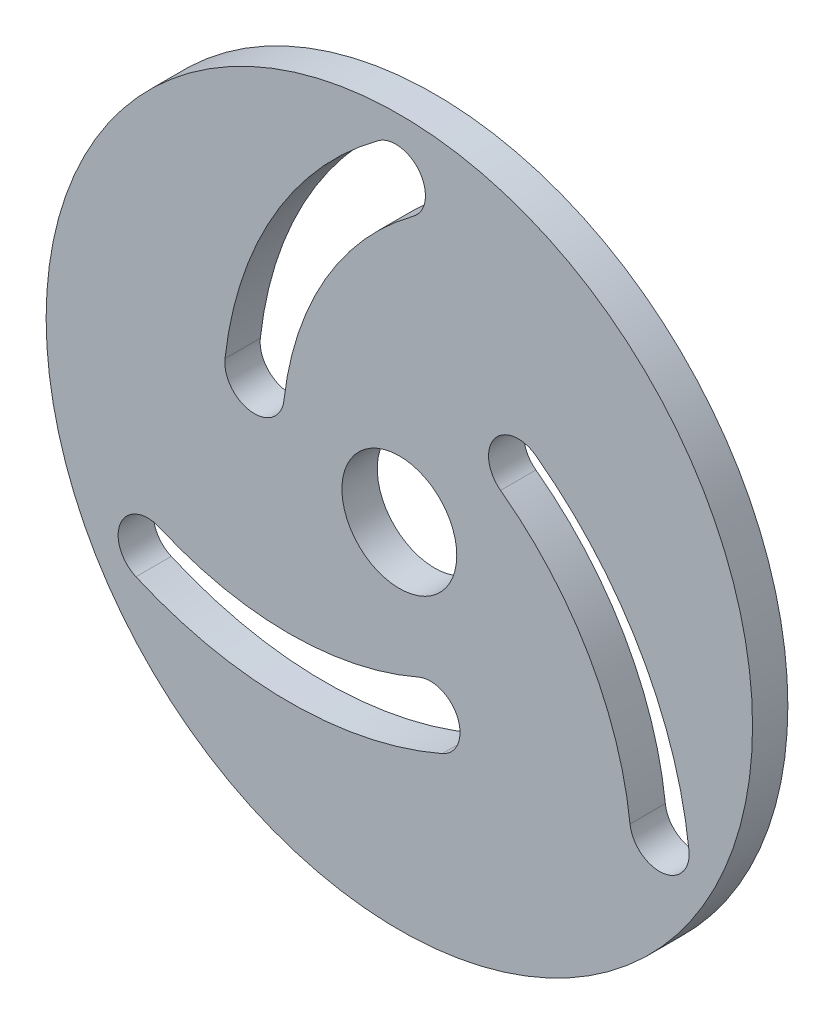
ISO-10303-21;
HEADER;
FILE_DESCRIPTION(('STEP AP214'),'2;1');
FILE_NAME('part.step','',(''),(''),'','','');
FILE_SCHEMA(('AUTOMOTIVE_DESIGN { 1 0 10303 214 1 1 1 1 }'));
ENDSEC;
DATA;
#1=APPLICATION_CONTEXT('core data for automotive mechanical design processes');
#2=APPLICATION_PROTOCOL_DEFINITION('international standard','automotive_design',2000,#1);
#3=PRODUCT_CONTEXT('',#1,'mechanical');
#4=PRODUCT('Part','Part','',(#3));
#5=PRODUCT_RELATED_PRODUCT_CATEGORY('part','',(#4));
#6=PRODUCT_DEFINITION_FORMATION('','',#4);
#7=PRODUCT_DEFINITION_CONTEXT('part definition',#1,'design');
#8=PRODUCT_DEFINITION('design','',#6,#7);
#9=PRODUCT_DEFINITION_SHAPE('','',#8);
#10=(LENGTH_UNIT() NAMED_UNIT(*) SI_UNIT(.MILLI.,.METRE.));
#11=(NAMED_UNIT(*) PLANE_ANGLE_UNIT() SI_UNIT($,.RADIAN.));
#12=(NAMED_UNIT(*) SI_UNIT($,.STERADIAN.) SOLID_ANGLE_UNIT());
#13=UNCERTAINTY_MEASURE_WITH_UNIT(LENGTH_MEASURE(1.E-05),#10,'distance_accuracy_value','');
#14=(GEOMETRIC_REPRESENTATION_CONTEXT(3) GLOBAL_UNCERTAINTY_ASSIGNED_CONTEXT((#13)) GLOBAL_UNIT_ASSIGNED_CONTEXT((#10,
#11,#12)) REPRESENTATION_CONTEXT('',''));
#15=CARTESIAN_POINT('',(0.,0.,0.));
#16=DIRECTION('',(0.,0.,1.));
#17=DIRECTION('',(1.,0.,0.));
#18=AXIS2_PLACEMENT_3D('',#15,#16,#17);
#19=CARTESIAN_POINT('',(-31.8476380113562,10.1977129006949,2.5));
#20=DIRECTION('',(0.,0.,-1.));
#21=DIRECTION('',(-1.,0.,0.));
#22=AXIS2_PLACEMENT_3D('',#19,#20,#21);
#23=CYLINDRICAL_SURFACE('',#22,2.1);
#24=CARTESIAN_POINT('',(-31.8476380113562,10.1977129006949,0.));
#25=DIRECTION('',(0.,0.,1.));
#26=DIRECTION('',(1.,0.,0.));
#27=AXIS2_PLACEMENT_3D('',#24,#25,#26);
#28=CIRCLE('',#27,2.1);
#29=CARTESIAN_POINT('',(-33.9344613373269,10.4325924574567,0.));
#30=VERTEX_POINT('',#29);
#31=CARTESIAN_POINT('',(-29.7608146853855,9.9628333439331,0.));
#32=VERTEX_POINT('',#31);
#33=EDGE_CURVE('E186',#30,#32,#28,.T.);
#34=ORIENTED_EDGE('',*,*,#33,.F.);
#35=DIRECTION('',(0.,0.,-1.));
#36=VECTOR('',#35,1.);
#37=CARTESIAN_POINT('',(-33.9344613373269,10.4325924574567,2.5));
#38=LINE('',#37,#36);
#39=CARTESIAN_POINT('',(-33.9344613373269,10.4325924574567,2.5));
#40=VERTEX_POINT('',#39);
#41=EDGE_CURVE('E11',#40,#30,#38,.T.);
#42=ORIENTED_EDGE('',*,*,#41,.F.);
#43=CARTESIAN_POINT('',(-31.8476380113562,10.1977129006949,2.5));
#44=DIRECTION('',(0.,0.,1.));
#45=DIRECTION('',(1.,0.,0.));
#46=AXIS2_PLACEMENT_3D('',#43,#44,#45);
#47=CIRCLE('',#46,2.1);
#48=CARTESIAN_POINT('',(-29.7608146853855,9.9628333439331,2.5));
#49=VERTEX_POINT('',#48);
#50=EDGE_CURVE('E148',#40,#49,#47,.T.);
#51=ORIENTED_EDGE('',*,*,#50,.T.);
#52=DIRECTION('',(0.,0.,-1.));
#53=VECTOR('',#52,1.);
#54=CARTESIAN_POINT('',(-29.7608146853855,9.9628333439331,2.5));
#55=LINE('',#54,#53);
#56=EDGE_CURVE('E100',#49,#32,#55,.T.);
#57=ORIENTED_EDGE('',*,*,#56,.T.);
#58=EDGE_LOOP('',(#34,#42,#51,#57));
#59=FACE_BOUND('',#58,.T.);
#60=ADVANCED_FACE('F35',(#59),#23,.F.);
#61=CARTESIAN_POINT('',(-7.00450317837179,7.40152770114974,2.5));
#62=DIRECTION('',(0.,0.,-1.));
#63=DIRECTION('',(-1.,0.,0.));
#64=AXIS2_PLACEMENT_3D('',#61,#62,#63);
#65=CYLINDRICAL_SURFACE('',#64,27.1);
#66=CARTESIAN_POINT('',(-7.00450317837179,7.40152770114974,0.));
#67=DIRECTION('',(0.,0.,1.));
#68=DIRECTION('',(1.,0.,0.));
#69=AXIS2_PLACEMENT_3D('',#66,#67,#68);
#70=CIRCLE('',#69,27.1);
#71=CARTESIAN_POINT('',(-23.094461337327,29.2080232115033,0.));
#72=VERTEX_POINT('',#71);
#73=EDGE_CURVE('E139',#72,#30,#70,.T.);
#74=ORIENTED_EDGE('',*,*,#73,.F.);
#75=DIRECTION('',(0.,0.,-1.));
#76=VECTOR('',#75,1.);
#77=CARTESIAN_POINT('',(-23.094461337327,29.2080232115033,2.5));
#78=LINE('',#77,#76);
#79=CARTESIAN_POINT('',(-23.094461337327,29.2080232115033,2.5));
#80=VERTEX_POINT('',#79);
#81=EDGE_CURVE('E45',#80,#72,#78,.T.);
#82=ORIENTED_EDGE('',*,*,#81,.F.);
#83=CARTESIAN_POINT('',(-7.00450317837179,7.40152770114974,2.5));
#84=DIRECTION('',(0.,0.,1.));
#85=DIRECTION('',(1.,0.,0.));
#86=AXIS2_PLACEMENT_3D('',#83,#84,#85);
#87=CIRCLE('',#86,27.1);
#88=EDGE_CURVE('E137',#80,#40,#87,.T.);
#89=ORIENTED_EDGE('',*,*,#88,.T.);
#90=ORIENTED_EDGE('',*,*,#41,.T.);
#91=EDGE_LOOP('',(#74,#82,#89,#90));
#92=FACE_BOUND('',#91,.T.);
#93=ADVANCED_FACE('F136',(#92),#65,.F.);
#94=CARTESIAN_POINT('',(-21.8476380113563,27.5182209763837,2.5));
#95=DIRECTION('',(0.,0.,-1.));
#96=DIRECTION('',(-1.,0.,0.));
#97=AXIS2_PLACEMENT_3D('',#94,#95,#96);
#98=CYLINDRICAL_SURFACE('',#97,2.1);
#99=CARTESIAN_POINT('',(-21.8476380113563,27.5182209763837,0.));
#100=DIRECTION('',(0.,0.,1.));
#101=DIRECTION('',(1.,0.,0.));
#102=AXIS2_PLACEMENT_3D('',#99,#100,#101);
#103=CIRCLE('',#102,2.1);
#104=CARTESIAN_POINT('',(-20.6008146853856,25.828418741264,0.));
#105=VERTEX_POINT('',#104);
#106=EDGE_CURVE('E190',#105,#72,#103,.T.);
#107=ORIENTED_EDGE('',*,*,#106,.F.);
#108=DIRECTION('',(0.,0.,-1.));
#109=VECTOR('',#108,1.);
#110=CARTESIAN_POINT('',(-20.6008146853856,25.828418741264,2.5));
#111=LINE('',#110,#109);
#112=CARTESIAN_POINT('',(-20.6008146853856,25.828418741264,2.5));
#113=VERTEX_POINT('',#112);
#114=EDGE_CURVE('E93',#113,#105,#111,.T.);
#115=ORIENTED_EDGE('',*,*,#114,.F.);
#116=CARTESIAN_POINT('',(-21.8476380113563,27.5182209763837,2.5));
#117=DIRECTION('',(0.,0.,1.));
#118=DIRECTION('',(1.,0.,0.));
#119=AXIS2_PLACEMENT_3D('',#116,#117,#118);
#120=CIRCLE('',#119,2.1);
#121=EDGE_CURVE('E147',#113,#80,#120,.T.);
#122=ORIENTED_EDGE('',*,*,#121,.T.);
#123=ORIENTED_EDGE('',*,*,#81,.T.);
#124=EDGE_LOOP('',(#107,#115,#122,#123));
#125=FACE_BOUND('',#124,.T.);
#126=ADVANCED_FACE('F150',(#125),#98,.F.);
#127=CARTESIAN_POINT('',(-28.0242802410875,-6.32008961851441,2.5));
#128=DIRECTION('',(0.,0.,-1.));
#129=DIRECTION('',(-1.,0.,0.));
#130=AXIS2_PLACEMENT_3D('',#127,#128,#129);
#131=CYLINDRICAL_SURFACE('',#130,27.1);
#132=CARTESIAN_POINT('',(-28.0242802410875,-6.32008961851441,0.));
#133=DIRECTION('',(0.,0.,1.));
#134=DIRECTION('',(1.,0.,0.));
#135=AXIS2_PLACEMENT_3D('',#132,#133,#134);
#136=CIRCLE('',#135,27.1);
#137=CARTESIAN_POINT('',(-1.09432208213236,-3.28902486220731,0.));
#138=VERTEX_POINT('',#137);
#139=CARTESIAN_POINT('',(-11.9343220821324,15.4864058918393,0.));
#140=VERTEX_POINT('',#139);
#141=EDGE_CURVE('E174',#138,#140,#136,.T.);
#142=ORIENTED_EDGE('',*,*,#141,.F.);
#143=DIRECTION('',(0.,0.,-1.));
#144=VECTOR('',#143,1.);
#145=CARTESIAN_POINT('',(-1.09432208213236,-3.28902486220731,2.5));
#146=LINE('',#145,#144);
#147=CARTESIAN_POINT('',(-1.09432208213236,-3.28902486220731,2.5));
#148=VERTEX_POINT('',#147);
#149=EDGE_CURVE('E202',#148,#138,#146,.T.);
#150=ORIENTED_EDGE('',*,*,#149,.F.);
#151=CARTESIAN_POINT('',(-28.0242802410875,-6.32008961851441,2.5));
#152=DIRECTION('',(0.,0.,1.));
#153=DIRECTION('',(1.,0.,0.));
#154=AXIS2_PLACEMENT_3D('',#151,#152,#153);
#155=CIRCLE('',#154,27.1);
#156=CARTESIAN_POINT('',(-11.9343220821324,15.4864058918393,2.5));
#157=VERTEX_POINT('',#156);
#158=EDGE_CURVE('E236',#148,#157,#155,.T.);
#159=ORIENTED_EDGE('',*,*,#158,.T.);
#160=DIRECTION('',(0.,0.,-1.));
#161=VECTOR('',#160,1.);
#162=CARTESIAN_POINT('',(-11.9343220821324,15.4864058918393,2.5));
#163=LINE('',#162,#161);
#164=EDGE_CURVE('E204',#157,#140,#163,.T.);
#165=ORIENTED_EDGE('',*,*,#164,.T.);
#166=EDGE_LOOP('',(#142,#150,#159,#165));
#167=FACE_BOUND('',#166,.T.);
#168=ADVANCED_FACE('F280',(#167),#131,.F.);
#169=CARTESIAN_POINT('',(-3.18114540810305,-3.5239044189691,2.5));
#170=DIRECTION('',(0.,0.,-1.));
#171=DIRECTION('',(-1.,0.,0.));
#172=AXIS2_PLACEMENT_3D('',#169,#170,#171);
#173=CYLINDRICAL_SURFACE('',#172,2.1);
#174=CARTESIAN_POINT('',(-3.18114540810305,-3.5239044189691,0.));
#175=DIRECTION('',(0.,0.,1.));
#176=DIRECTION('',(1.,0.,0.));
#177=AXIS2_PLACEMENT_3D('',#174,#175,#176);
#178=CIRCLE('',#177,2.1);
#179=CARTESIAN_POINT('',(-5.26796873407375,-3.75878397573092,0.));
#180=VERTEX_POINT('',#179);
#181=EDGE_CURVE('E177',#180,#138,#178,.T.);
#182=ORIENTED_EDGE('',*,*,#181,.F.);
#183=DIRECTION('',(0.,0.,-1.));
#184=VECTOR('',#183,1.);
#185=CARTESIAN_POINT('',(-5.26796873407375,-3.75878397573092,2.5));
#186=LINE('',#185,#184);
#187=CARTESIAN_POINT('',(-5.26796873407375,-3.75878397573092,2.5));
#188=VERTEX_POINT('',#187);
#189=EDGE_CURVE('E208',#188,#180,#186,.T.);
#190=ORIENTED_EDGE('',*,*,#189,.F.);
#191=CARTESIAN_POINT('',(-3.18114540810305,-3.5239044189691,2.5));
#192=DIRECTION('',(0.,0.,1.));
#193=DIRECTION('',(1.,0.,0.));
#194=AXIS2_PLACEMENT_3D('',#191,#192,#193);
#195=CIRCLE('',#194,2.1);
#196=EDGE_CURVE('E239',#188,#148,#195,.T.);
#197=ORIENTED_EDGE('',*,*,#196,.T.);
#198=ORIENTED_EDGE('',*,*,#149,.T.);
#199=EDGE_LOOP('',(#182,#190,#197,#198));
#200=FACE_BOUND('',#199,.T.);
#201=ADVANCED_FACE('F276',(#200),#173,.F.);
#202=CARTESIAN_POINT('',(-28.0242802410875,-6.32008961851441,2.5));
#203=DIRECTION('',(0.,0.,-1.));
#204=DIRECTION('',(-1.,0.,0.));
#205=AXIS2_PLACEMENT_3D('',#202,#203,#204);
#206=CYLINDRICAL_SURFACE('',#205,22.9);
#207=CARTESIAN_POINT('',(-28.0242802410875,-6.32008961851441,0.));
#208=DIRECTION('',(0.,0.,1.));
#209=DIRECTION('',(1.,0.,0.));
#210=AXIS2_PLACEMENT_3D('',#207,#208,#209);
#211=CIRCLE('',#210,22.9);
#212=CARTESIAN_POINT('',(-14.4279687340738,12.1068014216,0.));
#213=VERTEX_POINT('',#212);
#214=EDGE_CURVE('E180',#180,#213,#211,.T.);
#215=ORIENTED_EDGE('',*,*,#214,.T.);
#216=DIRECTION('',(0.,0.,-1.));
#217=VECTOR('',#216,1.);
#218=CARTESIAN_POINT('',(-14.4279687340738,12.1068014216,2.5));
#219=LINE('',#218,#217);
#220=CARTESIAN_POINT('',(-14.4279687340738,12.1068014216,2.5));
#221=VERTEX_POINT('',#220);
#222=EDGE_CURVE('E206',#221,#213,#219,.T.);
#223=ORIENTED_EDGE('',*,*,#222,.F.);
#224=CARTESIAN_POINT('',(-28.0242802410875,-6.32008961851441,2.5));
#225=DIRECTION('',(0.,0.,1.));
#226=DIRECTION('',(1.,0.,0.));
#227=AXIS2_PLACEMENT_3D('',#224,#225,#226);
#228=CIRCLE('',#227,22.9);
#229=EDGE_CURVE('E246',#188,#221,#228,.T.);
#230=ORIENTED_EDGE('',*,*,#229,.F.);
#231=ORIENTED_EDGE('',*,*,#189,.T.);
#232=EDGE_LOOP('',(#215,#223,#230,#231));
#233=FACE_BOUND('',#232,.T.);
#234=ADVANCED_FACE('F273',(#233),#206,.T.);
#235=CARTESIAN_POINT('',(-29.3976608895673,18.7443799595149,2.5));
#236=DIRECTION('',(0.,0.,-1.));
#237=DIRECTION('',(-1.,0.,0.));
#238=AXIS2_PLACEMENT_3D('',#235,#236,#237);
#239=CYLINDRICAL_SURFACE('',#238,27.1);
#240=CARTESIAN_POINT('',(-29.3976608895673,18.7443799595149,0.));
#241=DIRECTION('',(0.,0.,1.));
#242=DIRECTION('',(1.,0.,0.));
#243=AXIS2_PLACEMENT_3D('',#240,#241,#242);
#244=CIRCLE('',#243,27.1);
#245=CARTESIAN_POINT('',(-40.2376608895673,-6.09318030714579,0.));
#246=VERTEX_POINT('',#245);
#247=CARTESIAN_POINT('',(-18.5576608895672,-6.09318030714571,0.));
#248=VERTEX_POINT('',#247);
#249=EDGE_CURVE('E162',#246,#248,#244,.T.);
#250=ORIENTED_EDGE('',*,*,#249,.F.);
#251=DIRECTION('',(0.,0.,-1.));
#252=VECTOR('',#251,1.);
#253=CARTESIAN_POINT('',(-40.2376608895673,-6.09318030714579,2.5));
#254=LINE('',#253,#252);
#255=CARTESIAN_POINT('',(-40.2376608895673,-6.09318030714579,2.5));
#256=VERTEX_POINT('',#255);
#257=EDGE_CURVE('E39',#256,#246,#254,.T.);
#258=ORIENTED_EDGE('',*,*,#257,.F.);
#259=CARTESIAN_POINT('',(-29.3976608895673,18.7443799595149,2.5));
#260=DIRECTION('',(0.,0.,1.));
#261=DIRECTION('',(1.,0.,0.));
#262=AXIS2_PLACEMENT_3D('',#259,#260,#261);
#263=CIRCLE('',#262,27.1);
#264=CARTESIAN_POINT('',(-18.5576608895672,-6.09318030714571,2.5));
#265=VERTEX_POINT('',#264);
#266=EDGE_CURVE('E200',#256,#265,#263,.T.);
#267=ORIENTED_EDGE('',*,*,#266,.T.);
#268=DIRECTION('',(0.,0.,-1.));
#269=VECTOR('',#268,1.);
#270=CARTESIAN_POINT('',(-18.5576608895672,-6.09318030714571,2.5));
#271=LINE('',#270,#269);
#272=EDGE_CURVE('E161',#265,#248,#271,.T.);
#273=ORIENTED_EDGE('',*,*,#272,.T.);
#274=EDGE_LOOP('',(#250,#258,#267,#273));
#275=FACE_BOUND('',#274,.T.);
#276=ADVANCED_FACE('F37',(#275),#239,.F.);
#277=CARTESIAN_POINT('',(-39.3976608895673,-4.16849851526433,2.5));
#278=DIRECTION('',(0.,0.,-1.));
#279=DIRECTION('',(-1.,0.,0.));
#280=AXIS2_PLACEMENT_3D('',#277,#278,#279);
#281=CYLINDRICAL_SURFACE('',#280,2.1);
#282=CARTESIAN_POINT('',(-39.3976608895673,-4.16849851526433,0.));
#283=DIRECTION('',(0.,0.,1.));
#284=DIRECTION('',(1.,0.,0.));
#285=AXIS2_PLACEMENT_3D('',#282,#283,#284);
#286=CIRCLE('',#285,2.1);
#287=CARTESIAN_POINT('',(-38.5576608895673,-2.24381672338287,0.));
#288=VERTEX_POINT('',#287);
#289=EDGE_CURVE('E165',#288,#246,#286,.T.);
#290=ORIENTED_EDGE('',*,*,#289,.F.);
#291=DIRECTION('',(0.,0.,-1.));
#292=VECTOR('',#291,1.);
#293=CARTESIAN_POINT('',(-38.5576608895673,-2.24381672338287,2.5));
#294=LINE('',#293,#292);
#295=CARTESIAN_POINT('',(-38.5576608895673,-2.24381672338287,2.5));
#296=VERTEX_POINT('',#295);
#297=EDGE_CURVE('E213',#296,#288,#294,.T.);
#298=ORIENTED_EDGE('',*,*,#297,.F.);
#299=CARTESIAN_POINT('',(-39.3976608895673,-4.16849851526433,2.5));
#300=DIRECTION('',(0.,0.,1.));
#301=DIRECTION('',(1.,0.,0.));
#302=AXIS2_PLACEMENT_3D('',#299,#300,#301);
#303=CIRCLE('',#302,2.1);
#304=EDGE_CURVE('E222',#296,#256,#303,.T.);
#305=ORIENTED_EDGE('',*,*,#304,.T.);
#306=ORIENTED_EDGE('',*,*,#257,.T.);
#307=EDGE_LOOP('',(#290,#298,#305,#306));
#308=FACE_BOUND('',#307,.T.);
#309=ADVANCED_FACE('F220',(#308),#281,.F.);
#310=CARTESIAN_POINT('',(-29.3976608895673,18.7443799595149,2.5));
#311=DIRECTION('',(0.,0.,-1.));
#312=DIRECTION('',(-1.,0.,0.));
#313=AXIS2_PLACEMENT_3D('',#310,#311,#312);
#314=CYLINDRICAL_SURFACE('',#313,22.9);
#315=CARTESIAN_POINT('',(-29.3976608895673,18.7443799595149,0.));
#316=DIRECTION('',(0.,0.,1.));
#317=DIRECTION('',(1.,0.,0.));
#318=AXIS2_PLACEMENT_3D('',#315,#316,#317);
#319=CIRCLE('',#318,22.9);
#320=CARTESIAN_POINT('',(-20.2376608895673,-2.24381672338281,0.));
#321=VERTEX_POINT('',#320);
#322=EDGE_CURVE('E168',#288,#321,#319,.T.);
#323=ORIENTED_EDGE('',*,*,#322,.T.);
#324=DIRECTION('',(0.,0.,-1.));
#325=VECTOR('',#324,1.);
#326=CARTESIAN_POINT('',(-20.2376608895673,-2.24381672338281,2.5));
#327=LINE('',#326,#325);
#328=CARTESIAN_POINT('',(-20.2376608895673,-2.24381672338281,2.5));
#329=VERTEX_POINT('',#328);
#330=EDGE_CURVE('E212',#329,#321,#327,.T.);
#331=ORIENTED_EDGE('',*,*,#330,.F.);
#332=CARTESIAN_POINT('',(-29.3976608895673,18.7443799595149,2.5));
#333=DIRECTION('',(0.,0.,1.));
#334=DIRECTION('',(1.,0.,0.));
#335=AXIS2_PLACEMENT_3D('',#332,#333,#334);
#336=CIRCLE('',#335,22.9);
#337=EDGE_CURVE('E230',#296,#329,#336,.T.);
#338=ORIENTED_EDGE('',*,*,#337,.F.);
#339=ORIENTED_EDGE('',*,*,#297,.T.);
#340=EDGE_LOOP('',(#323,#331,#338,#339));
#341=FACE_BOUND('',#340,.T.);
#342=ADVANCED_FACE('F228',(#341),#314,.T.);
#343=CARTESIAN_POINT('',(-21.5945908318808,6.57444440269253,2.5));
#344=DIRECTION('',(0.,0.,-1.));
#345=DIRECTION('',(-1.,0.,0.));
#346=AXIS2_PLACEMENT_3D('',#343,#344,#345);
#347=CYLINDRICAL_SURFACE('',#346,4.064);
#348=CARTESIAN_POINT('',(-21.5945908318808,6.57444440269253,2.5));
#349=DIRECTION('',(0.,0.,1.));
#350=DIRECTION('',(1.,0.,0.));
#351=AXIS2_PLACEMENT_3D('',#348,#349,#350);
#352=CIRCLE('',#351,4.064);
#353=CARTESIAN_POINT('',(-17.5305908318808,6.57444440269253,2.5));
#354=VERTEX_POINT('',#353);
#355=EDGE_CURVE('E152',#354,#354,#352,.T.);
#356=ORIENTED_EDGE('',*,*,#355,.T.);
#357=EDGE_LOOP('',(#356));
#358=FACE_BOUND('',#357,.T.);
#359=CARTESIAN_POINT('',(-21.5945908318808,6.57444440269253,0.));
#360=DIRECTION('',(0.,0.,1.));
#361=DIRECTION('',(1.,0.,0.));
#362=AXIS2_PLACEMENT_3D('',#359,#360,#361);
#363=CIRCLE('',#362,4.064);
#364=CARTESIAN_POINT('',(-17.5305908318808,6.57444440269253,0.));
#365=VERTEX_POINT('',#364);
#366=EDGE_CURVE('E194',#365,#365,#363,.T.);
#367=ORIENTED_EDGE('',*,*,#366,.F.);
#368=EDGE_LOOP('',(#367));
#369=FACE_BOUND('',#368,.T.);
#370=ADVANCED_FACE('F255',(#358,#369),#347,.F.);
#371=CARTESIAN_POINT('',(-7.00450317837179,7.40152770114974,2.5));
#372=DIRECTION('',(0.,0.,-1.));
#373=DIRECTION('',(-1.,0.,0.));
#374=AXIS2_PLACEMENT_3D('',#371,#372,#373);
#375=CYLINDRICAL_SURFACE('',#374,22.9);
#376=CARTESIAN_POINT('',(-7.00450317837179,7.40152770114974,0.));
#377=DIRECTION('',(0.,0.,1.));
#378=DIRECTION('',(1.,0.,0.));
#379=AXIS2_PLACEMENT_3D('',#376,#377,#378);
#380=CIRCLE('',#379,22.9);
#381=EDGE_CURVE('E192',#105,#32,#380,.T.);
#382=ORIENTED_EDGE('',*,*,#381,.T.);
#383=ORIENTED_EDGE('',*,*,#56,.F.);
#384=CARTESIAN_POINT('',(-7.00450317837179,7.40152770114974,2.5));
#385=DIRECTION('',(0.,0.,1.));
#386=DIRECTION('',(1.,0.,0.));
#387=AXIS2_PLACEMENT_3D('',#384,#385,#386);
#388=CIRCLE('',#387,22.9);
#389=EDGE_CURVE('E54',#113,#49,#388,.T.);
#390=ORIENTED_EDGE('',*,*,#389,.F.);
#391=ORIENTED_EDGE('',*,*,#114,.T.);
#392=EDGE_LOOP('',(#382,#383,#390,#391));
#393=FACE_BOUND('',#392,.T.);
#394=ADVANCED_FACE('F252',(#393),#375,.T.);
#395=CARTESIAN_POINT('',(-13.1811454081031,13.7966036567196,2.5));
#396=DIRECTION('',(0.,0.,-1.));
#397=DIRECTION('',(-1.,0.,0.));
#398=AXIS2_PLACEMENT_3D('',#395,#396,#397);
#399=CYLINDRICAL_SURFACE('',#398,2.1);
#400=CARTESIAN_POINT('',(-13.1811454081031,13.7966036567196,0.));
#401=DIRECTION('',(0.,0.,1.));
#402=DIRECTION('',(1.,0.,0.));
#403=AXIS2_PLACEMENT_3D('',#400,#401,#402);
#404=CIRCLE('',#403,2.1);
#405=EDGE_CURVE('E183',#140,#213,#404,.T.);
#406=ORIENTED_EDGE('',*,*,#405,.F.);
#407=ORIENTED_EDGE('',*,*,#164,.F.);
#408=CARTESIAN_POINT('',(-13.1811454081031,13.7966036567196,2.5));
#409=DIRECTION('',(0.,0.,1.));
#410=DIRECTION('',(1.,0.,0.));
#411=AXIS2_PLACEMENT_3D('',#408,#409,#410);
#412=CIRCLE('',#411,2.1);
#413=EDGE_CURVE('E248',#157,#221,#412,.T.);
#414=ORIENTED_EDGE('',*,*,#413,.T.);
#415=ORIENTED_EDGE('',*,*,#222,.T.);
#416=EDGE_LOOP('',(#406,#407,#414,#415));
#417=FACE_BOUND('',#416,.T.);
#418=ADVANCED_FACE('F254',(#417),#399,.F.);
#419=CARTESIAN_POINT('',(-19.3976608895673,-4.16849851526426,2.5));
#420=DIRECTION('',(0.,0.,-1.));
#421=DIRECTION('',(-1.,0.,0.));
#422=AXIS2_PLACEMENT_3D('',#419,#420,#421);
#423=CYLINDRICAL_SURFACE('',#422,2.1);
#424=CARTESIAN_POINT('',(-19.3976608895673,-4.16849851526426,0.));
#425=DIRECTION('',(0.,0.,1.));
#426=DIRECTION('',(1.,0.,0.));
#427=AXIS2_PLACEMENT_3D('',#424,#425,#426);
#428=CIRCLE('',#427,2.1);
#429=EDGE_CURVE('E171',#248,#321,#428,.T.);
#430=ORIENTED_EDGE('',*,*,#429,.F.);
#431=ORIENTED_EDGE('',*,*,#272,.F.);
#432=CARTESIAN_POINT('',(-19.3976608895673,-4.16849851526426,2.5));
#433=DIRECTION('',(0.,0.,1.));
#434=DIRECTION('',(1.,0.,0.));
#435=AXIS2_PLACEMENT_3D('',#432,#433,#434);
#436=CIRCLE('',#435,2.1);
#437=EDGE_CURVE('E233',#265,#329,#436,.T.);
#438=ORIENTED_EDGE('',*,*,#437,.T.);
#439=ORIENTED_EDGE('',*,*,#330,.T.);
#440=EDGE_LOOP('',(#430,#431,#438,#439));
#441=FACE_BOUND('',#440,.T.);
#442=ADVANCED_FACE('F234',(#441),#423,.F.);
#443=CARTESIAN_POINT('',(-21.5945908318808,6.57444440269253,2.5));
#444=DIRECTION('',(0.,0.,-1.));
#445=DIRECTION('',(-1.,0.,0.));
#446=AXIS2_PLACEMENT_3D('',#443,#444,#445);
#447=CYLINDRICAL_SURFACE('',#446,25.);
#448=CARTESIAN_POINT('',(-21.5945908318808,6.57444440269253,2.5));
#449=DIRECTION('',(0.,0.,1.));
#450=DIRECTION('',(1.,0.,0.));
#451=AXIS2_PLACEMENT_3D('',#448,#449,#450);
#452=CIRCLE('',#451,25.);
#453=CARTESIAN_POINT('',(3.40540916811924,6.57444440269253,2.5));
#454=VERTEX_POINT('',#453);
#455=EDGE_CURVE('E158',#454,#454,#452,.T.);
#456=ORIENTED_EDGE('',*,*,#455,.F.);
#457=EDGE_LOOP('',(#456));
#458=FACE_BOUND('',#457,.T.);
#459=CARTESIAN_POINT('',(-21.5945908318808,6.57444440269253,0.));
#460=DIRECTION('',(0.,0.,1.));
#461=DIRECTION('',(1.,0.,0.));
#462=AXIS2_PLACEMENT_3D('',#459,#460,#461);
#463=CIRCLE('',#462,25.);
#464=CARTESIAN_POINT('',(3.40540916811924,6.57444440269253,0.));
#465=VERTEX_POINT('',#464);
#466=EDGE_CURVE('E197',#465,#465,#463,.T.);
#467=ORIENTED_EDGE('',*,*,#466,.T.);
#468=EDGE_LOOP('',(#467));
#469=FACE_BOUND('',#468,.T.);
#470=ADVANCED_FACE('F287',(#458,#469),#447,.T.);
#471=CARTESIAN_POINT('',(0.,0.,2.5));
#472=DIRECTION('',(0.,0.,1.));
#473=DIRECTION('',(1.,0.,0.));
#474=AXIS2_PLACEMENT_3D('',#471,#472,#473);
#475=PLANE('',#474);
#476=ORIENTED_EDGE('',*,*,#266,.F.);
#477=ORIENTED_EDGE('',*,*,#304,.F.);
#478=ORIENTED_EDGE('',*,*,#337,.T.);
#479=ORIENTED_EDGE('',*,*,#437,.F.);
#480=EDGE_LOOP('',(#476,#477,#478,#479));
#481=FACE_BOUND('',#480,.T.);
#482=ORIENTED_EDGE('',*,*,#158,.F.);
#483=ORIENTED_EDGE('',*,*,#196,.F.);
#484=ORIENTED_EDGE('',*,*,#229,.T.);
#485=ORIENTED_EDGE('',*,*,#413,.F.);
#486=EDGE_LOOP('',(#482,#483,#484,#485));
#487=FACE_BOUND('',#486,.T.);
#488=ORIENTED_EDGE('',*,*,#50,.F.);
#489=ORIENTED_EDGE('',*,*,#88,.F.);
#490=ORIENTED_EDGE('',*,*,#121,.F.);
#491=ORIENTED_EDGE('',*,*,#389,.T.);
#492=EDGE_LOOP('',(#488,#489,#490,#491));
#493=FACE_BOUND('',#492,.T.);
#494=ORIENTED_EDGE('',*,*,#355,.F.);
#495=EDGE_LOOP('',(#494));
#496=FACE_BOUND('',#495,.T.);
#497=ORIENTED_EDGE('',*,*,#455,.T.);
#498=EDGE_LOOP('',(#497));
#499=FACE_BOUND('',#498,.T.);
#500=ADVANCED_FACE('F145',(#481,#487,#493,#496,#499),#475,.T.);
#501=CARTESIAN_POINT('',(0.,0.,0.));
#502=DIRECTION('',(0.,0.,1.));
#503=DIRECTION('',(1.,0.,0.));
#504=AXIS2_PLACEMENT_3D('',#501,#502,#503);
#505=PLANE('',#504);
#506=ORIENTED_EDGE('',*,*,#249,.T.);
#507=ORIENTED_EDGE('',*,*,#429,.T.);
#508=ORIENTED_EDGE('',*,*,#322,.F.);
#509=ORIENTED_EDGE('',*,*,#289,.T.);
#510=EDGE_LOOP('',(#506,#507,#508,#509));
#511=FACE_BOUND('',#510,.T.);
#512=ORIENTED_EDGE('',*,*,#141,.T.);
#513=ORIENTED_EDGE('',*,*,#405,.T.);
#514=ORIENTED_EDGE('',*,*,#214,.F.);
#515=ORIENTED_EDGE('',*,*,#181,.T.);
#516=EDGE_LOOP('',(#512,#513,#514,#515));
#517=FACE_BOUND('',#516,.T.);
#518=ORIENTED_EDGE('',*,*,#33,.T.);
#519=ORIENTED_EDGE('',*,*,#381,.F.);
#520=ORIENTED_EDGE('',*,*,#106,.T.);
#521=ORIENTED_EDGE('',*,*,#73,.T.);
#522=EDGE_LOOP('',(#518,#519,#520,#521));
#523=FACE_BOUND('',#522,.T.);
#524=ORIENTED_EDGE('',*,*,#366,.T.);
#525=EDGE_LOOP('',(#524));
#526=FACE_BOUND('',#525,.T.);
#527=ORIENTED_EDGE('',*,*,#466,.F.);
#528=EDGE_LOOP('',(#527));
#529=FACE_BOUND('',#528,.T.);
#530=ADVANCED_FACE('F225',(#511,#517,#523,#526,#529),#505,.F.);
#531=CLOSED_SHELL('',(#60,#93,#126,#168,#201,#234,#276,#309,#342,#370,#394,#418,#442,#470,#500,#530));
#532=MANIFOLD_SOLID_BREP('B2',#531);
#533=ADVANCED_BREP_SHAPE_REPRESENTATION('',(#18,#532),#14);
#534=SHAPE_DEFINITION_REPRESENTATION(#9,#533);
ENDSEC;
END-ISO-10303-21;
